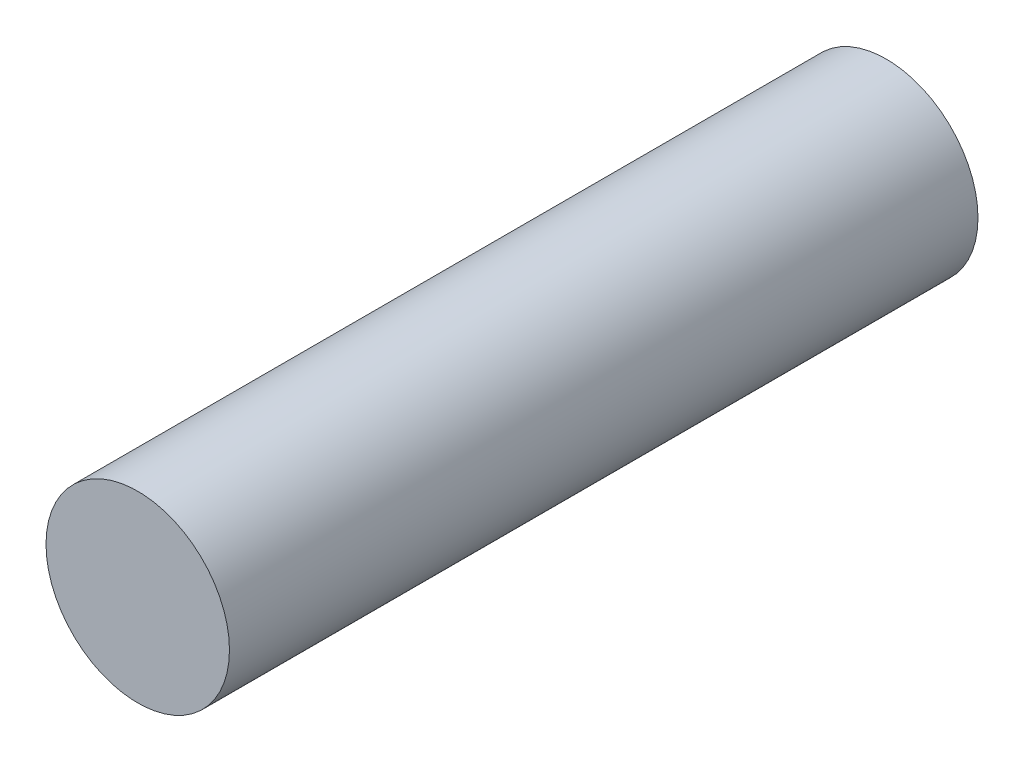
ISO-10303-21;
HEADER;
FILE_DESCRIPTION(('STEP AP214'),'2;1');
FILE_NAME('part.step','',(''),(''),'','','');
FILE_SCHEMA(('AUTOMOTIVE_DESIGN { 1 0 10303 214 1 1 1 1 }'));
ENDSEC;
DATA;
#1=APPLICATION_CONTEXT('core data for automotive mechanical design processes');
#2=APPLICATION_PROTOCOL_DEFINITION('international standard','automotive_design',2000,#1);
#3=PRODUCT_CONTEXT('',#1,'mechanical');
#4=PRODUCT('Part','Part','',(#3));
#5=PRODUCT_RELATED_PRODUCT_CATEGORY('part','',(#4));
#6=PRODUCT_DEFINITION_FORMATION('','',#4);
#7=PRODUCT_DEFINITION_CONTEXT('part definition',#1,'design');
#8=PRODUCT_DEFINITION('design','',#6,#7);
#9=PRODUCT_DEFINITION_SHAPE('','',#8);
#10=(LENGTH_UNIT() NAMED_UNIT(*) SI_UNIT(.MILLI.,.METRE.));
#11=(NAMED_UNIT(*) PLANE_ANGLE_UNIT() SI_UNIT($,.RADIAN.));
#12=(NAMED_UNIT(*) SI_UNIT($,.STERADIAN.) SOLID_ANGLE_UNIT());
#13=UNCERTAINTY_MEASURE_WITH_UNIT(LENGTH_MEASURE(1.E-05),#10,'distance_accuracy_value','');
#14=(GEOMETRIC_REPRESENTATION_CONTEXT(3) GLOBAL_UNCERTAINTY_ASSIGNED_CONTEXT((#13)) GLOBAL_UNIT_ASSIGNED_CONTEXT((#10,
#11,#12)) REPRESENTATION_CONTEXT('',''));
#15=CARTESIAN_POINT('',(0.,0.,0.));
#16=DIRECTION('',(0.,0.,1.));
#17=DIRECTION('',(1.,0.,0.));
#18=AXIS2_PLACEMENT_3D('',#15,#16,#17);
#19=CARTESIAN_POINT('',(0.,0.,40.8));
#20=DIRECTION('',(0.,0.,-1.));
#21=DIRECTION('',(-1.,0.,0.));
#22=AXIS2_PLACEMENT_3D('',#19,#20,#21);
#23=CYLINDRICAL_SURFACE('',#22,5.);
#24=CARTESIAN_POINT('',(0.,0.,40.8));
#25=DIRECTION('',(0.,0.,1.));
#26=DIRECTION('',(1.,0.,0.));
#27=AXIS2_PLACEMENT_3D('',#24,#25,#26);
#28=CIRCLE('',#27,5.);
#29=CARTESIAN_POINT('',(5.,0.,40.8));
#30=VERTEX_POINT('',#29);
#31=EDGE_CURVE('E10',#30,#30,#28,.T.);
#32=ORIENTED_EDGE('',*,*,#31,.F.);
#33=EDGE_LOOP('',(#32));
#34=FACE_BOUND('',#33,.T.);
#35=CARTESIAN_POINT('',(0.,0.,0.));
#36=DIRECTION('',(0.,0.,1.));
#37=DIRECTION('',(1.,0.,0.));
#38=AXIS2_PLACEMENT_3D('',#35,#36,#37);
#39=CIRCLE('',#38,5.);
#40=CARTESIAN_POINT('',(5.,0.,0.));
#41=VERTEX_POINT('',#40);
#42=EDGE_CURVE('E35',#41,#41,#39,.T.);
#43=ORIENTED_EDGE('',*,*,#42,.T.);
#44=EDGE_LOOP('',(#43));
#45=FACE_BOUND('',#44,.T.);
#46=ADVANCED_FACE('F32',(#34,#45),#23,.T.);
#47=CARTESIAN_POINT('',(0.,0.,40.8));
#48=DIRECTION('',(0.,0.,1.));
#49=DIRECTION('',(1.,0.,0.));
#50=AXIS2_PLACEMENT_3D('',#47,#48,#49);
#51=PLANE('',#50);
#52=ORIENTED_EDGE('',*,*,#31,.T.);
#53=EDGE_LOOP('',(#52));
#54=FACE_BOUND('',#53,.T.);
#55=ADVANCED_FACE('F47',(#54),#51,.T.);
#56=CARTESIAN_POINT('',(0.,0.,0.));
#57=DIRECTION('',(0.,0.,1.));
#58=DIRECTION('',(1.,0.,0.));
#59=AXIS2_PLACEMENT_3D('',#56,#57,#58);
#60=PLANE('',#59);
#61=ORIENTED_EDGE('',*,*,#42,.F.);
#62=EDGE_LOOP('',(#61));
#63=FACE_BOUND('',#62,.T.);
#64=ADVANCED_FACE('F45',(#63),#60,.F.);
#65=CLOSED_SHELL('',(#46,#55,#64));
#66=MANIFOLD_SOLID_BREP('B2',#65);
#67=ADVANCED_BREP_SHAPE_REPRESENTATION('',(#18,#66),#14);
#68=SHAPE_DEFINITION_REPRESENTATION(#9,#67);
ENDSEC;
END-ISO-10303-21;
